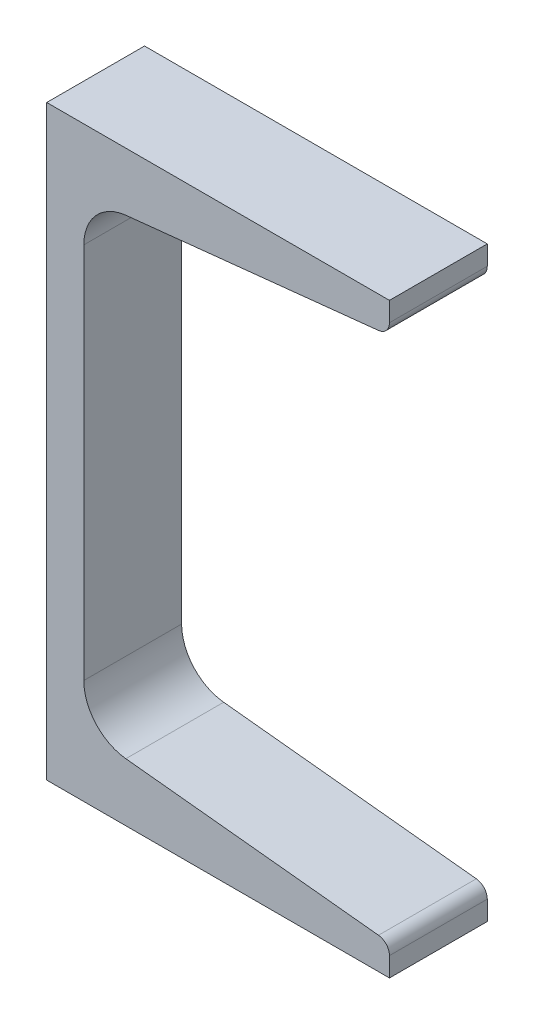
ISO-10303-21;
HEADER;
FILE_DESCRIPTION(('STEP AP214'),'2;1');
FILE_NAME('part.step','',(''),(''),'','','');
FILE_SCHEMA(('AUTOMOTIVE_DESIGN { 1 0 10303 214 1 1 1 1 }'));
ENDSEC;
DATA;
#1=APPLICATION_CONTEXT('core data for automotive mechanical design processes');
#2=APPLICATION_PROTOCOL_DEFINITION('international standard','automotive_design',2000,#1);
#3=PRODUCT_CONTEXT('',#1,'mechanical');
#4=PRODUCT('Part','Part','',(#3));
#5=PRODUCT_RELATED_PRODUCT_CATEGORY('part','',(#4));
#6=PRODUCT_DEFINITION_FORMATION('','',#4);
#7=PRODUCT_DEFINITION_CONTEXT('part definition',#1,'design');
#8=PRODUCT_DEFINITION('design','',#6,#7);
#9=PRODUCT_DEFINITION_SHAPE('','',#8);
#10=(LENGTH_UNIT() NAMED_UNIT(*) SI_UNIT(.MILLI.,.METRE.));
#11=(NAMED_UNIT(*) PLANE_ANGLE_UNIT() SI_UNIT($,.RADIAN.));
#12=(NAMED_UNIT(*) SI_UNIT($,.STERADIAN.) SOLID_ANGLE_UNIT());
#13=UNCERTAINTY_MEASURE_WITH_UNIT(LENGTH_MEASURE(1.E-05),#10,'distance_accuracy_value','');
#14=(GEOMETRIC_REPRESENTATION_CONTEXT(3) GLOBAL_UNCERTAINTY_ASSIGNED_CONTEXT((#13)) GLOBAL_UNIT_ASSIGNED_CONTEXT((#10,
#11,#12)) REPRESENTATION_CONTEXT('',''));
#15=CARTESIAN_POINT('',(0.,0.,0.));
#16=DIRECTION('',(0.,0.,1.));
#17=DIRECTION('',(1.,0.,0.));
#18=AXIS2_PLACEMENT_3D('',#15,#16,#17);
#19=CARTESIAN_POINT('',(0.,152.4,12.7));
#20=DIRECTION('',(1.,0.,0.));
#21=DIRECTION('',(0.,0.,-1.));
#22=AXIS2_PLACEMENT_3D('',#19,#20,#21);
#23=PLANE('',#22);
#24=DIRECTION('',(0.,-1.,0.));
#25=VECTOR('',#24,1.);
#26=CARTESIAN_POINT('',(0.,152.4,-12.7));
#27=LINE('',#26,#25);
#28=CARTESIAN_POINT('',(0.,152.4,-12.7));
#29=VERTEX_POINT('',#28);
#30=CARTESIAN_POINT('',(0.,0.,-12.7));
#31=VERTEX_POINT('',#30);
#32=EDGE_CURVE('E136',#29,#31,#27,.T.);
#33=ORIENTED_EDGE('',*,*,#32,.T.);
#34=DIRECTION('',(0.,0.,-1.));
#35=VECTOR('',#34,1.);
#36=CARTESIAN_POINT('',(0.,0.,12.7));
#37=LINE('',#36,#35);
#38=CARTESIAN_POINT('',(0.,0.,12.7));
#39=VERTEX_POINT('',#38);
#40=EDGE_CURVE('E134',#39,#31,#37,.T.);
#41=ORIENTED_EDGE('',*,*,#40,.F.);
#42=DIRECTION('',(0.,-1.,0.));
#43=VECTOR('',#42,1.);
#44=CARTESIAN_POINT('',(0.,152.4,12.7));
#45=LINE('',#44,#43);
#46=CARTESIAN_POINT('',(0.,152.4,12.7));
#47=VERTEX_POINT('',#46);
#48=EDGE_CURVE('E120',#47,#39,#45,.T.);
#49=ORIENTED_EDGE('',*,*,#48,.F.);
#50=DIRECTION('',(0.,0.,-1.));
#51=VECTOR('',#50,1.);
#52=CARTESIAN_POINT('',(0.,152.4,12.7));
#53=LINE('',#52,#51);
#54=EDGE_CURVE('E165',#47,#29,#53,.T.);
#55=ORIENTED_EDGE('',*,*,#54,.T.);
#56=EDGE_LOOP('',(#33,#41,#49,#55));
#57=FACE_BOUND('',#56,.T.);
#58=ADVANCED_FACE('F31',(#57),#23,.F.);
#59=CARTESIAN_POINT('',(89.0016,0.,12.7));
#60=DIRECTION('',(0.,-1.,0.));
#61=DIRECTION('',(1.,0.,0.));
#62=AXIS2_PLACEMENT_3D('',#59,#60,#61);
#63=PLANE('',#62);
#64=DIRECTION('',(-1.,0.,0.));
#65=VECTOR('',#64,1.);
#66=CARTESIAN_POINT('',(89.0016,0.,-12.7));
#67=LINE('',#66,#65);
#68=CARTESIAN_POINT('',(89.0016,0.,-12.7));
#69=VERTEX_POINT('',#68);
#70=EDGE_CURVE('E167',#69,#31,#67,.T.);
#71=ORIENTED_EDGE('',*,*,#70,.F.);
#72=DIRECTION('',(0.,0.,-1.));
#73=VECTOR('',#72,1.);
#74=CARTESIAN_POINT('',(89.0016,0.,12.7));
#75=LINE('',#74,#73);
#76=CARTESIAN_POINT('',(89.0016,0.,12.7));
#77=VERTEX_POINT('',#76);
#78=EDGE_CURVE('E141',#77,#69,#75,.T.);
#79=ORIENTED_EDGE('',*,*,#78,.F.);
#80=DIRECTION('',(-1.,0.,0.));
#81=VECTOR('',#80,1.);
#82=CARTESIAN_POINT('',(89.0016,0.,12.7));
#83=LINE('',#82,#81);
#84=EDGE_CURVE('E125',#77,#39,#83,.T.);
#85=ORIENTED_EDGE('',*,*,#84,.T.);
#86=ORIENTED_EDGE('',*,*,#40,.T.);
#87=EDGE_LOOP('',(#71,#79,#85,#86));
#88=FACE_BOUND('',#87,.T.);
#89=ADVANCED_FACE('F143',(#88),#63,.T.);
#90=CARTESIAN_POINT('',(89.0016,0.,12.7));
#91=DIRECTION('',(-1.,0.,0.));
#92=DIRECTION('',(0.,-1.,0.));
#93=AXIS2_PLACEMENT_3D('',#90,#91,#92);
#94=PLANE('',#93);
#95=DIRECTION('',(0.,1.,0.));
#96=VECTOR('',#95,1.);
#97=CARTESIAN_POINT('',(89.0016,0.,-12.7));
#98=LINE('',#97,#96);
#99=CARTESIAN_POINT('',(89.0016,5.03489282264604,-12.7));
#100=VERTEX_POINT('',#99);
#101=EDGE_CURVE('E169',#69,#100,#98,.T.);
#102=ORIENTED_EDGE('',*,*,#101,.T.);
#103=DIRECTION('',(0.,0.,-1.));
#104=VECTOR('',#103,1.);
#105=CARTESIAN_POINT('',(89.0016,5.03489282264604,12.7));
#106=LINE('',#105,#104);
#107=CARTESIAN_POINT('',(89.0016,5.03489282264604,12.7));
#108=VERTEX_POINT('',#107);
#109=EDGE_CURVE('E208',#100,#108,#106,.F.);
#110=ORIENTED_EDGE('',*,*,#109,.T.);
#111=DIRECTION('',(0.,1.,0.));
#112=VECTOR('',#111,1.);
#113=CARTESIAN_POINT('',(89.0016,0.,12.7));
#114=LINE('',#113,#112);
#115=EDGE_CURVE('E145',#77,#108,#114,.T.);
#116=ORIENTED_EDGE('',*,*,#115,.F.);
#117=ORIENTED_EDGE('',*,*,#78,.T.);
#118=EDGE_LOOP('',(#102,#110,#116,#117));
#119=FACE_BOUND('',#118,.T.);
#120=ADVANCED_FACE('F239',(#119),#94,.F.);
#121=CARTESIAN_POINT('',(20.5441889758409,15.0888394972535,12.7));
#122=DIRECTION('',(0.104528463267646,0.994521895368274,0.));
#123=DIRECTION('',(-0.994521895368274,0.104528463267646,0.));
#124=AXIS2_PLACEMENT_3D('',#121,#122,#123);
#125=PLANE('',#124);
#126=DIRECTION('',(0.994521895368274,-0.104528463267646,0.));
#127=VECTOR('',#126,1.);
#128=CARTESIAN_POINT('',(20.5441889758409,15.0888394972535,12.7));
#129=LINE('',#128,#127);
#130=CARTESIAN_POINT('',(20.5441889758409,15.0888394972535,12.7));
#131=VERTEX_POINT('',#130);
#132=CARTESIAN_POINT('',(86.1584778708748,8.1924998404403,12.7));
#133=VERTEX_POINT('',#132);
#134=EDGE_CURVE('E147',#131,#133,#129,.T.);
#135=ORIENTED_EDGE('',*,*,#134,.T.);
#136=DIRECTION('',(0.,0.,-1.));
#137=VECTOR('',#136,1.);
#138=CARTESIAN_POINT('',(86.1584778708748,8.1924998404403,-12.7));
#139=LINE('',#138,#137);
#140=CARTESIAN_POINT('',(86.1584778708748,8.1924998404403,-12.7));
#141=VERTEX_POINT('',#140);
#142=EDGE_CURVE('E140',#133,#141,#139,.T.);
#143=ORIENTED_EDGE('',*,*,#142,.T.);
#144=DIRECTION('',(0.994521895368274,-0.104528463267646,0.));
#145=VECTOR('',#144,1.);
#146=CARTESIAN_POINT('',(20.5441889758409,15.0888394972535,-12.7));
#147=LINE('',#146,#145);
#148=CARTESIAN_POINT('',(20.5441889758409,15.0888394972535,-12.7));
#149=VERTEX_POINT('',#148);
#150=EDGE_CURVE('E172',#149,#141,#147,.T.);
#151=ORIENTED_EDGE('',*,*,#150,.F.);
#152=DIRECTION('',(0.,0.,-1.));
#153=VECTOR('',#152,1.);
#154=CARTESIAN_POINT('',(20.5441889758409,15.0888394972535,12.7));
#155=LINE('',#154,#153);
#156=EDGE_CURVE('E199',#131,#149,#155,.T.);
#157=ORIENTED_EDGE('',*,*,#156,.F.);
#158=EDGE_LOOP('',(#135,#143,#151,#157));
#159=FACE_BOUND('',#158,.T.);
#160=ADVANCED_FACE('F255',(#159),#125,.T.);
#161=CARTESIAN_POINT('',(21.8186,27.2140504455835,12.7));
#162=DIRECTION('',(0.,0.,-1.));
#163=DIRECTION('',(-1.,0.,0.));
#164=AXIS2_PLACEMENT_3D('',#161,#162,#163);
#165=CYLINDRICAL_SURFACE('',#164,12.192);
#166=CARTESIAN_POINT('',(21.8186,27.2140504455835,-12.7));
#167=DIRECTION('',(0.,0.,1.));
#168=DIRECTION('',(1.,0.,0.));
#169=AXIS2_PLACEMENT_3D('',#166,#167,#168);
#170=CIRCLE('',#169,12.192);
#171=CARTESIAN_POINT('',(9.62659999999999,27.2140504455835,-12.7));
#172=VERTEX_POINT('',#171);
#173=EDGE_CURVE('E175',#172,#149,#170,.T.);
#174=ORIENTED_EDGE('',*,*,#173,.F.);
#175=DIRECTION('',(0.,0.,-1.));
#176=VECTOR('',#175,1.);
#177=CARTESIAN_POINT('',(9.62659999999999,27.2140504455835,12.7));
#178=LINE('',#177,#176);
#179=CARTESIAN_POINT('',(9.62659999999999,27.2140504455835,12.7));
#180=VERTEX_POINT('',#179);
#181=EDGE_CURVE('E197',#180,#172,#178,.T.);
#182=ORIENTED_EDGE('',*,*,#181,.F.);
#183=CARTESIAN_POINT('',(21.8186,27.2140504455835,12.7));
#184=DIRECTION('',(0.,0.,1.));
#185=DIRECTION('',(1.,0.,0.));
#186=AXIS2_PLACEMENT_3D('',#183,#184,#185);
#187=CIRCLE('',#186,12.192);
#188=EDGE_CURVE('E152',#180,#131,#187,.T.);
#189=ORIENTED_EDGE('',*,*,#188,.T.);
#190=ORIENTED_EDGE('',*,*,#156,.T.);
#191=EDGE_LOOP('',(#174,#182,#189,#190));
#192=FACE_BOUND('',#191,.T.);
#193=ADVANCED_FACE('F259',(#192),#165,.F.);
#194=CARTESIAN_POINT('',(9.62659999999998,125.185949554416,12.7));
#195=DIRECTION('',(1.,0.,0.));
#196=DIRECTION('',(0.,1.,0.));
#197=AXIS2_PLACEMENT_3D('',#194,#195,#196);
#198=PLANE('',#197);
#199=DIRECTION('',(0.,-1.,0.));
#200=VECTOR('',#199,1.);
#201=CARTESIAN_POINT('',(9.62659999999998,125.185949554416,-12.7));
#202=LINE('',#201,#200);
#203=CARTESIAN_POINT('',(9.6266,125.185949554416,-12.7));
#204=VERTEX_POINT('',#203);
#205=EDGE_CURVE('E178',#204,#172,#202,.T.);
#206=ORIENTED_EDGE('',*,*,#205,.F.);
#207=DIRECTION('',(0.,0.,-1.));
#208=VECTOR('',#207,1.);
#209=CARTESIAN_POINT('',(9.6266,125.185949554416,12.7));
#210=LINE('',#209,#208);
#211=CARTESIAN_POINT('',(9.6266,125.185949554416,12.7));
#212=VERTEX_POINT('',#211);
#213=EDGE_CURVE('E195',#212,#204,#210,.T.);
#214=ORIENTED_EDGE('',*,*,#213,.F.);
#215=DIRECTION('',(0.,-1.,0.));
#216=VECTOR('',#215,1.);
#217=CARTESIAN_POINT('',(9.62659999999998,125.185949554416,12.7));
#218=LINE('',#217,#216);
#219=EDGE_CURVE('E155',#212,#180,#218,.T.);
#220=ORIENTED_EDGE('',*,*,#219,.T.);
#221=ORIENTED_EDGE('',*,*,#181,.T.);
#222=EDGE_LOOP('',(#206,#214,#220,#221));
#223=FACE_BOUND('',#222,.T.);
#224=ADVANCED_FACE('F263',(#223),#198,.T.);
#225=CARTESIAN_POINT('',(21.8186,125.185949554416,12.7));
#226=DIRECTION('',(0.,0.,-1.));
#227=DIRECTION('',(-1.,0.,0.));
#228=AXIS2_PLACEMENT_3D('',#225,#226,#227);
#229=CYLINDRICAL_SURFACE('',#228,12.192);
#230=CARTESIAN_POINT('',(21.8186,125.185949554416,-12.7));
#231=DIRECTION('',(0.,0.,-1.));
#232=DIRECTION('',(-1.,0.,0.));
#233=AXIS2_PLACEMENT_3D('',#230,#231,#232);
#234=CIRCLE('',#233,12.192);
#235=CARTESIAN_POINT('',(20.5441889758408,137.311160502746,-12.7));
#236=VERTEX_POINT('',#235);
#237=EDGE_CURVE('E181',#204,#236,#234,.T.);
#238=ORIENTED_EDGE('',*,*,#237,.T.);
#239=DIRECTION('',(0.,0.,-1.));
#240=VECTOR('',#239,1.);
#241=CARTESIAN_POINT('',(20.5441889758408,137.311160502746,12.7));
#242=LINE('',#241,#240);
#243=CARTESIAN_POINT('',(20.5441889758408,137.311160502746,12.7));
#244=VERTEX_POINT('',#243);
#245=EDGE_CURVE('E192',#244,#236,#242,.T.);
#246=ORIENTED_EDGE('',*,*,#245,.F.);
#247=CARTESIAN_POINT('',(21.8186,125.185949554416,12.7));
#248=DIRECTION('',(0.,0.,-1.));
#249=DIRECTION('',(-1.,0.,0.));
#250=AXIS2_PLACEMENT_3D('',#247,#248,#249);
#251=CIRCLE('',#250,12.192);
#252=EDGE_CURVE('E158',#212,#244,#251,.T.);
#253=ORIENTED_EDGE('',*,*,#252,.F.);
#254=ORIENTED_EDGE('',*,*,#213,.T.);
#255=EDGE_LOOP('',(#238,#246,#253,#254));
#256=FACE_BOUND('',#255,.T.);
#257=ADVANCED_FACE('F268',(#256),#229,.F.);
#258=CARTESIAN_POINT('',(20.5441889758408,137.311160502746,12.7));
#259=DIRECTION('',(-0.104528463267646,0.994521895368274,0.));
#260=DIRECTION('',(-0.994521895368274,-0.104528463267646,0.));
#261=AXIS2_PLACEMENT_3D('',#258,#259,#260);
#262=PLANE('',#261);
#263=DIRECTION('',(0.994521895368274,0.104528463267646,0.));
#264=VECTOR('',#263,1.);
#265=CARTESIAN_POINT('',(20.5441889758408,137.311160502746,-12.7));
#266=LINE('',#265,#264);
#267=CARTESIAN_POINT('',(86.1584778708748,144.20750015956,-12.7));
#268=VERTEX_POINT('',#267);
#269=EDGE_CURVE('E183',#236,#268,#266,.T.);
#270=ORIENTED_EDGE('',*,*,#269,.T.);
#271=DIRECTION('',(0.,0.,-1.));
#272=VECTOR('',#271,1.);
#273=CARTESIAN_POINT('',(86.1584778708748,144.20750015956,12.7));
#274=LINE('',#273,#272);
#275=CARTESIAN_POINT('',(86.1584778708748,144.20750015956,12.7));
#276=VERTEX_POINT('',#275);
#277=EDGE_CURVE('E11',#268,#276,#274,.F.);
#278=ORIENTED_EDGE('',*,*,#277,.T.);
#279=DIRECTION('',(0.994521895368274,0.104528463267646,0.));
#280=VECTOR('',#279,1.);
#281=CARTESIAN_POINT('',(20.5441889758408,137.311160502746,12.7));
#282=LINE('',#281,#280);
#283=EDGE_CURVE('E160',#244,#276,#282,.T.);
#284=ORIENTED_EDGE('',*,*,#283,.F.);
#285=ORIENTED_EDGE('',*,*,#245,.T.);
#286=EDGE_LOOP('',(#270,#278,#284,#285));
#287=FACE_BOUND('',#286,.T.);
#288=ADVANCED_FACE('F231',(#287),#262,.F.);
#289=CARTESIAN_POINT('',(89.0016,152.4,12.7));
#290=DIRECTION('',(1.,0.,0.));
#291=DIRECTION('',(0.,1.,0.));
#292=AXIS2_PLACEMENT_3D('',#289,#290,#291);
#293=PLANE('',#292);
#294=DIRECTION('',(0.,-1.,0.));
#295=VECTOR('',#294,1.);
#296=CARTESIAN_POINT('',(89.0016,152.4,12.7));
#297=LINE('',#296,#295);
#298=CARTESIAN_POINT('',(89.0016,152.4,12.7));
#299=VERTEX_POINT('',#298);
#300=CARTESIAN_POINT('',(89.0016,147.365107177354,12.7));
#301=VERTEX_POINT('',#300);
#302=EDGE_CURVE('E162',#299,#301,#297,.T.);
#303=ORIENTED_EDGE('',*,*,#302,.T.);
#304=DIRECTION('',(0.,0.,-1.));
#305=VECTOR('',#304,1.);
#306=CARTESIAN_POINT('',(89.0016,147.365107177354,-12.7));
#307=LINE('',#306,#305);
#308=CARTESIAN_POINT('',(89.0016,147.365107177354,-12.7));
#309=VERTEX_POINT('',#308);
#310=EDGE_CURVE('E39',#301,#309,#307,.T.);
#311=ORIENTED_EDGE('',*,*,#310,.T.);
#312=DIRECTION('',(0.,-1.,0.));
#313=VECTOR('',#312,1.);
#314=CARTESIAN_POINT('',(89.0016,152.4,-12.7));
#315=LINE('',#314,#313);
#316=CARTESIAN_POINT('',(89.0016,152.4,-12.7));
#317=VERTEX_POINT('',#316);
#318=EDGE_CURVE('E185',#317,#309,#315,.T.);
#319=ORIENTED_EDGE('',*,*,#318,.F.);
#320=DIRECTION('',(0.,0.,-1.));
#321=VECTOR('',#320,1.);
#322=CARTESIAN_POINT('',(89.0016,152.4,12.7));
#323=LINE('',#322,#321);
#324=EDGE_CURVE('E190',#299,#317,#323,.T.);
#325=ORIENTED_EDGE('',*,*,#324,.F.);
#326=EDGE_LOOP('',(#303,#311,#319,#325));
#327=FACE_BOUND('',#326,.T.);
#328=ADVANCED_FACE('F216',(#327),#293,.T.);
#329=CARTESIAN_POINT('',(89.0016,152.4,12.7));
#330=DIRECTION('',(0.,-1.,0.));
#331=DIRECTION('',(0.,0.,-1.));
#332=AXIS2_PLACEMENT_3D('',#329,#330,#331);
#333=PLANE('',#332);
#334=DIRECTION('',(-1.,0.,0.));
#335=VECTOR('',#334,1.);
#336=CARTESIAN_POINT('',(89.0016,152.4,-12.7));
#337=LINE('',#336,#335);
#338=EDGE_CURVE('E131',#317,#29,#337,.T.);
#339=ORIENTED_EDGE('',*,*,#338,.T.);
#340=ORIENTED_EDGE('',*,*,#54,.F.);
#341=DIRECTION('',(-1.,0.,0.));
#342=VECTOR('',#341,1.);
#343=CARTESIAN_POINT('',(89.0016,152.4,12.7));
#344=LINE('',#343,#342);
#345=EDGE_CURVE('E127',#299,#47,#344,.T.);
#346=ORIENTED_EDGE('',*,*,#345,.F.);
#347=ORIENTED_EDGE('',*,*,#324,.T.);
#348=EDGE_LOOP('',(#339,#340,#346,#347));
#349=FACE_BOUND('',#348,.T.);
#350=ADVANCED_FACE('F223',(#349),#333,.F.);
#351=CARTESIAN_POINT('',(21.8186,27.2140504455835,12.7));
#352=DIRECTION('',(0.,0.,1.));
#353=DIRECTION('',(1.,0.,0.));
#354=AXIS2_PLACEMENT_3D('',#351,#352,#353);
#355=PLANE('',#354);
#356=ORIENTED_EDGE('',*,*,#115,.T.);
#357=CARTESIAN_POINT('',(85.8266,5.03489282264604,12.7));
#358=DIRECTION('',(0.,0.,1.));
#359=DIRECTION('',(1.,0.,0.));
#360=AXIS2_PLACEMENT_3D('',#357,#358,#359);
#361=CIRCLE('',#360,3.175);
#362=EDGE_CURVE('E211',#108,#133,#361,.T.);
#363=ORIENTED_EDGE('',*,*,#362,.T.);
#364=ORIENTED_EDGE('',*,*,#134,.F.);
#365=ORIENTED_EDGE('',*,*,#188,.F.);
#366=ORIENTED_EDGE('',*,*,#219,.F.);
#367=ORIENTED_EDGE('',*,*,#252,.T.);
#368=ORIENTED_EDGE('',*,*,#283,.T.);
#369=CARTESIAN_POINT('',(85.8266,147.365107177354,12.7));
#370=DIRECTION('',(0.,0.,1.));
#371=DIRECTION('',(1.,0.,0.));
#372=AXIS2_PLACEMENT_3D('',#369,#370,#371);
#373=CIRCLE('',#372,3.175);
#374=EDGE_CURVE('E46',#276,#301,#373,.T.);
#375=ORIENTED_EDGE('',*,*,#374,.T.);
#376=ORIENTED_EDGE('',*,*,#302,.F.);
#377=ORIENTED_EDGE('',*,*,#345,.T.);
#378=ORIENTED_EDGE('',*,*,#48,.T.);
#379=ORIENTED_EDGE('',*,*,#84,.F.);
#380=EDGE_LOOP('',(#356,#363,#364,#365,#366,#367,#368,#375,#376,#377,#378,#379));
#381=FACE_BOUND('',#380,.T.);
#382=ADVANCED_FACE('F123',(#381),#355,.T.);
#383=CARTESIAN_POINT('',(21.8186,27.2140504455835,-12.7));
#384=DIRECTION('',(0.,0.,1.));
#385=DIRECTION('',(1.,0.,0.));
#386=AXIS2_PLACEMENT_3D('',#383,#384,#385);
#387=PLANE('',#386);
#388=ORIENTED_EDGE('',*,*,#150,.T.);
#389=CARTESIAN_POINT('',(85.8266,5.03489282264604,-12.7));
#390=DIRECTION('',(0.,0.,1.));
#391=DIRECTION('',(1.,0.,0.));
#392=AXIS2_PLACEMENT_3D('',#389,#390,#391);
#393=CIRCLE('',#392,3.175);
#394=EDGE_CURVE('E206',#141,#100,#393,.F.);
#395=ORIENTED_EDGE('',*,*,#394,.T.);
#396=ORIENTED_EDGE('',*,*,#101,.F.);
#397=ORIENTED_EDGE('',*,*,#70,.T.);
#398=ORIENTED_EDGE('',*,*,#32,.F.);
#399=ORIENTED_EDGE('',*,*,#338,.F.);
#400=ORIENTED_EDGE('',*,*,#318,.T.);
#401=CARTESIAN_POINT('',(85.8266,147.365107177354,-12.7));
#402=DIRECTION('',(0.,0.,1.));
#403=DIRECTION('',(1.,0.,0.));
#404=AXIS2_PLACEMENT_3D('',#401,#402,#403);
#405=CIRCLE('',#404,3.175);
#406=EDGE_CURVE('E204',#309,#268,#405,.F.);
#407=ORIENTED_EDGE('',*,*,#406,.T.);
#408=ORIENTED_EDGE('',*,*,#269,.F.);
#409=ORIENTED_EDGE('',*,*,#237,.F.);
#410=ORIENTED_EDGE('',*,*,#205,.T.);
#411=ORIENTED_EDGE('',*,*,#173,.T.);
#412=EDGE_LOOP('',(#388,#395,#396,#397,#398,#399,#400,#407,#408,#409,#410,#411));
#413=FACE_BOUND('',#412,.T.);
#414=ADVANCED_FACE('F220',(#413),#387,.F.);
#415=CARTESIAN_POINT('',(85.8266,5.03489282264604,12.7));
#416=DIRECTION('',(0.,0.,1.));
#417=DIRECTION('',(1.,0.,0.));
#418=AXIS2_PLACEMENT_3D('',#415,#416,#417);
#419=CYLINDRICAL_SURFACE('',#418,3.175);
#420=ORIENTED_EDGE('',*,*,#362,.F.);
#421=ORIENTED_EDGE('',*,*,#109,.F.);
#422=ORIENTED_EDGE('',*,*,#394,.F.);
#423=ORIENTED_EDGE('',*,*,#142,.F.);
#424=EDGE_LOOP('',(#420,#421,#422,#423));
#425=FACE_BOUND('',#424,.T.);
#426=ADVANCED_FACE('F242',(#425),#419,.T.);
#427=CARTESIAN_POINT('',(85.8266,147.365107177354,12.7));
#428=DIRECTION('',(0.,0.,1.));
#429=DIRECTION('',(1.,0.,0.));
#430=AXIS2_PLACEMENT_3D('',#427,#428,#429);
#431=CYLINDRICAL_SURFACE('',#430,3.175);
#432=ORIENTED_EDGE('',*,*,#374,.F.);
#433=ORIENTED_EDGE('',*,*,#277,.F.);
#434=ORIENTED_EDGE('',*,*,#406,.F.);
#435=ORIENTED_EDGE('',*,*,#310,.F.);
#436=EDGE_LOOP('',(#432,#433,#434,#435));
#437=FACE_BOUND('',#436,.T.);
#438=ADVANCED_FACE('F33',(#437),#431,.T.);
#439=CLOSED_SHELL('',(#58,#89,#120,#160,#193,#224,#257,#288,#328,#350,#382,#414,#426,#438));
#440=MANIFOLD_SOLID_BREP('B2',#439);
#441=ADVANCED_BREP_SHAPE_REPRESENTATION('',(#18,#440),#14);
#442=SHAPE_DEFINITION_REPRESENTATION(#9,#441);
ENDSEC;
END-ISO-10303-21;
